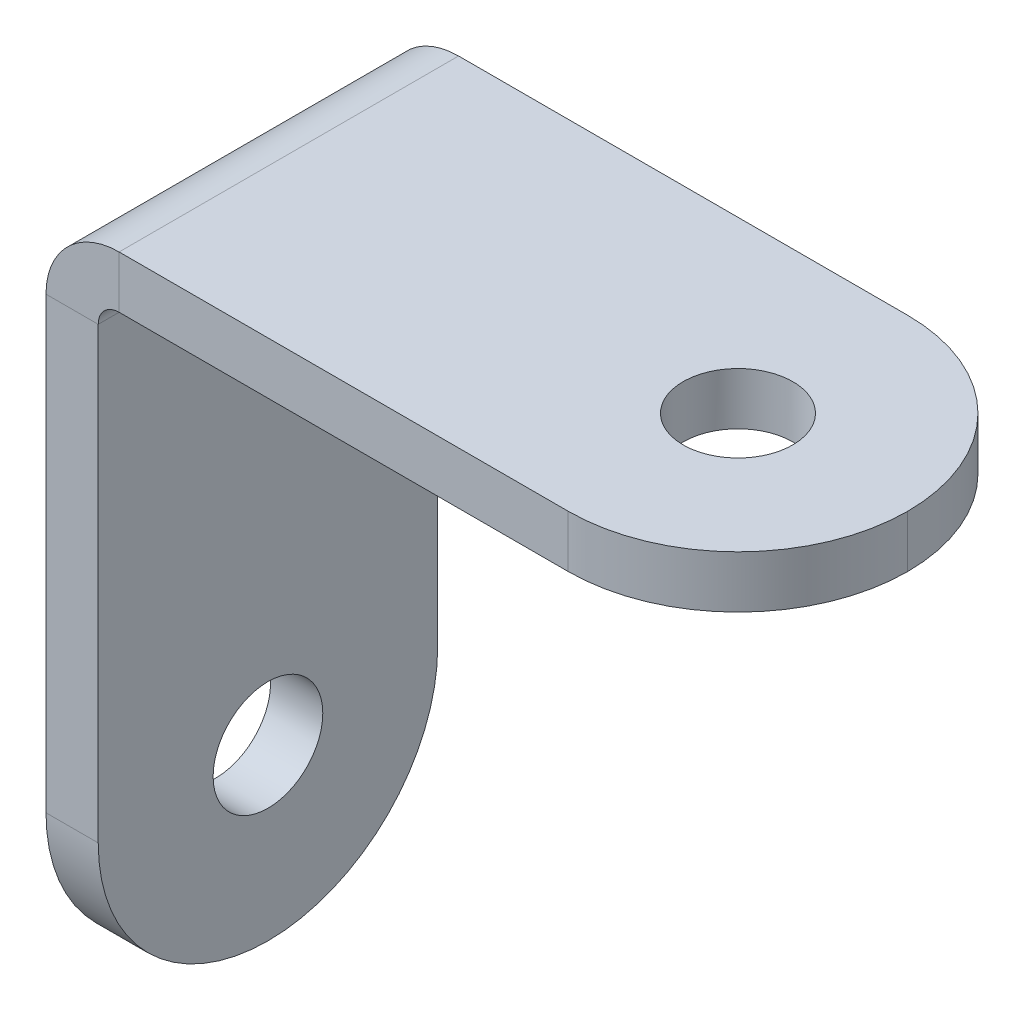
ISO-10303-21;
HEADER;
FILE_DESCRIPTION(('STEP AP214'),'2;1');
FILE_NAME('part.step','',(''),(''),'','','');
FILE_SCHEMA(('AUTOMOTIVE_DESIGN { 1 0 10303 214 1 1 1 1 }'));
ENDSEC;
DATA;
#1=APPLICATION_CONTEXT('core data for automotive mechanical design processes');
#2=APPLICATION_PROTOCOL_DEFINITION('international standard','automotive_design',2000,#1);
#3=PRODUCT_CONTEXT('',#1,'mechanical');
#4=PRODUCT('Part','Part','',(#3));
#5=PRODUCT_RELATED_PRODUCT_CATEGORY('part','',(#4));
#6=PRODUCT_DEFINITION_FORMATION('','',#4);
#7=PRODUCT_DEFINITION_CONTEXT('part definition',#1,'design');
#8=PRODUCT_DEFINITION('design','',#6,#7);
#9=PRODUCT_DEFINITION_SHAPE('','',#8);
#10=(LENGTH_UNIT() NAMED_UNIT(*) SI_UNIT(.MILLI.,.METRE.));
#11=(NAMED_UNIT(*) PLANE_ANGLE_UNIT() SI_UNIT($,.RADIAN.));
#12=(NAMED_UNIT(*) SI_UNIT($,.STERADIAN.) SOLID_ANGLE_UNIT());
#13=UNCERTAINTY_MEASURE_WITH_UNIT(LENGTH_MEASURE(1.E-05),#10,'distance_accuracy_value','');
#14=(GEOMETRIC_REPRESENTATION_CONTEXT(3) GLOBAL_UNCERTAINTY_ASSIGNED_CONTEXT((#13)) GLOBAL_UNIT_ASSIGNED_CONTEXT((#10,
#11,#12)) REPRESENTATION_CONTEXT('',''));
#15=CARTESIAN_POINT('',(0.,0.,0.));
#16=DIRECTION('',(0.,0.,1.));
#17=DIRECTION('',(1.,0.,0.));
#18=AXIS2_PLACEMENT_3D('',#15,#16,#17);
#19=CARTESIAN_POINT('',(-10.45,13.25,13.));
#20=DIRECTION('',(0.,0.,1.));
#21=DIRECTION('',(1.,0.,0.));
#22=AXIS2_PLACEMENT_3D('',#19,#20,#21);
#23=PLANE('',#22);
#24=DIRECTION('',(0.,-1.,0.));
#25=VECTOR('',#24,1.);
#26=CARTESIAN_POINT('',(-10.45,13.25,13.));
#27=LINE('',#26,#25);
#28=CARTESIAN_POINT('',(-10.45,13.25,13.));
#29=VERTEX_POINT('',#28);
#30=CARTESIAN_POINT('',(-10.45,11.25,13.));
#31=VERTEX_POINT('',#30);
#32=EDGE_CURVE('E126',#29,#31,#27,.T.);
#33=ORIENTED_EDGE('',*,*,#32,.F.);
#34=CARTESIAN_POINT('',(-10.45,10.45,13.));
#35=DIRECTION('',(0.,0.,-1.));
#36=DIRECTION('',(-1.,0.,0.));
#37=AXIS2_PLACEMENT_3D('',#34,#35,#36);
#38=CIRCLE('',#37,2.8);
#39=CARTESIAN_POINT('',(-13.25,10.45,13.));
#40=VERTEX_POINT('',#39);
#41=EDGE_CURVE('E121',#29,#40,#38,.F.);
#42=ORIENTED_EDGE('',*,*,#41,.T.);
#43=DIRECTION('',(-1.,0.,0.));
#44=VECTOR('',#43,1.);
#45=CARTESIAN_POINT('',(-11.25,10.45,13.));
#46=LINE('',#45,#44);
#47=CARTESIAN_POINT('',(-11.25,10.45,13.));
#48=VERTEX_POINT('',#47);
#49=EDGE_CURVE('E115',#48,#40,#46,.T.);
#50=ORIENTED_EDGE('',*,*,#49,.F.);
#51=CARTESIAN_POINT('',(-10.45,10.45,13.));
#52=DIRECTION('',(0.,0.,1.));
#53=DIRECTION('',(1.,0.,0.));
#54=AXIS2_PLACEMENT_3D('',#51,#52,#53);
#55=CIRCLE('',#54,0.8);
#56=EDGE_CURVE('E119',#31,#48,#55,.T.);
#57=ORIENTED_EDGE('',*,*,#56,.F.);
#58=EDGE_LOOP('',(#33,#42,#50,#57));
#59=FACE_BOUND('',#58,.T.);
#60=ADVANCED_FACE('F37',(#59),#23,.T.);
#61=CARTESIAN_POINT('',(-11.25,10.45,13.));
#62=DIRECTION('',(0.,0.,1.));
#63=DIRECTION('',(1.,0.,0.));
#64=AXIS2_PLACEMENT_3D('',#61,#62,#63);
#65=PLANE('',#64);
#66=DIRECTION('',(1.,0.,0.));
#67=VECTOR('',#66,1.);
#68=CARTESIAN_POINT('',(13.25,11.25,13.));
#69=LINE('',#68,#67);
#70=CARTESIAN_POINT('',(6.75,11.25,13.));
#71=VERTEX_POINT('',#70);
#72=EDGE_CURVE('E153',#71,#31,#69,.F.);
#73=ORIENTED_EDGE('',*,*,#72,.F.);
#74=DIRECTION('',(0.,-1.,0.));
#75=VECTOR('',#74,1.);
#76=CARTESIAN_POINT('',(6.75,10.45,13.));
#77=LINE('',#76,#75);
#78=CARTESIAN_POINT('',(6.75,13.25,13.));
#79=VERTEX_POINT('',#78);
#80=EDGE_CURVE('E11',#71,#79,#77,.F.);
#81=ORIENTED_EDGE('',*,*,#80,.T.);
#82=DIRECTION('',(-1.,0.,0.));
#83=VECTOR('',#82,1.);
#84=CARTESIAN_POINT('',(13.25,13.25,13.));
#85=LINE('',#84,#83);
#86=EDGE_CURVE('E155',#79,#29,#85,.T.);
#87=ORIENTED_EDGE('',*,*,#86,.T.);
#88=ORIENTED_EDGE('',*,*,#32,.T.);
#89=EDGE_LOOP('',(#73,#81,#87,#88));
#90=FACE_BOUND('',#89,.T.);
#91=ADVANCED_FACE('F248',(#90),#65,.T.);
#92=CARTESIAN_POINT('',(-13.25,10.45,0.));
#93=DIRECTION('',(0.,0.,-1.));
#94=DIRECTION('',(-1.,0.,0.));
#95=AXIS2_PLACEMENT_3D('',#92,#93,#94);
#96=PLANE('',#95);
#97=DIRECTION('',(1.,0.,0.));
#98=VECTOR('',#97,1.);
#99=CARTESIAN_POINT('',(-13.25,10.45,0.));
#100=LINE('',#99,#98);
#101=CARTESIAN_POINT('',(-13.25,10.45,0.));
#102=VERTEX_POINT('',#101);
#103=CARTESIAN_POINT('',(-11.25,10.45,0.));
#104=VERTEX_POINT('',#103);
#105=EDGE_CURVE('E127',#102,#104,#100,.T.);
#106=ORIENTED_EDGE('',*,*,#105,.F.);
#107=CARTESIAN_POINT('',(-10.45,10.45,0.));
#108=DIRECTION('',(0.,0.,-1.));
#109=DIRECTION('',(-1.,0.,0.));
#110=AXIS2_PLACEMENT_3D('',#107,#108,#109);
#111=CIRCLE('',#110,2.8);
#112=CARTESIAN_POINT('',(-10.45,13.25,0.));
#113=VERTEX_POINT('',#112);
#114=EDGE_CURVE('E173',#113,#102,#111,.F.);
#115=ORIENTED_EDGE('',*,*,#114,.F.);
#116=DIRECTION('',(0.,1.,0.));
#117=VECTOR('',#116,1.);
#118=CARTESIAN_POINT('',(-10.45,11.25,0.));
#119=LINE('',#118,#117);
#120=CARTESIAN_POINT('',(-10.45,11.25,0.));
#121=VERTEX_POINT('',#120);
#122=EDGE_CURVE('E142',#121,#113,#119,.T.);
#123=ORIENTED_EDGE('',*,*,#122,.F.);
#124=CARTESIAN_POINT('',(-10.45,10.45,0.));
#125=DIRECTION('',(0.,0.,1.));
#126=DIRECTION('',(1.,0.,0.));
#127=AXIS2_PLACEMENT_3D('',#124,#125,#126);
#128=CIRCLE('',#127,0.8);
#129=EDGE_CURVE('E167',#121,#104,#128,.T.);
#130=ORIENTED_EDGE('',*,*,#129,.T.);
#131=EDGE_LOOP('',(#106,#115,#123,#130));
#132=FACE_BOUND('',#131,.T.);
#133=ADVANCED_FACE('F241',(#132),#96,.T.);
#134=CARTESIAN_POINT('',(-10.45,11.25,0.));
#135=DIRECTION('',(0.,0.,-1.));
#136=DIRECTION('',(-1.,0.,0.));
#137=AXIS2_PLACEMENT_3D('',#134,#135,#136);
#138=PLANE('',#137);
#139=DIRECTION('',(0.,1.,0.));
#140=VECTOR('',#139,1.);
#141=CARTESIAN_POINT('',(-11.25,13.25,0.));
#142=LINE('',#141,#140);
#143=CARTESIAN_POINT('',(-11.25,-6.75000000000001,0.));
#144=VERTEX_POINT('',#143);
#145=EDGE_CURVE('E138',#104,#144,#142,.F.);
#146=ORIENTED_EDGE('',*,*,#145,.T.);
#147=DIRECTION('',(-1.,0.,0.));
#148=VECTOR('',#147,1.);
#149=CARTESIAN_POINT('',(-10.45,-6.75,0.));
#150=LINE('',#149,#148);
#151=CARTESIAN_POINT('',(-13.25,-6.75000000000001,0.));
#152=VERTEX_POINT('',#151);
#153=EDGE_CURVE('E187',#144,#152,#150,.T.);
#154=ORIENTED_EDGE('',*,*,#153,.T.);
#155=DIRECTION('',(0.,-1.,0.));
#156=VECTOR('',#155,1.);
#157=CARTESIAN_POINT('',(-13.25,13.25,0.));
#158=LINE('',#157,#156);
#159=EDGE_CURVE('E162',#102,#152,#158,.T.);
#160=ORIENTED_EDGE('',*,*,#159,.F.);
#161=ORIENTED_EDGE('',*,*,#105,.T.);
#162=EDGE_LOOP('',(#146,#154,#160,#161));
#163=FACE_BOUND('',#162,.T.);
#164=ADVANCED_FACE('F231',(#163),#138,.T.);
#165=CARTESIAN_POINT('',(-13.25,13.25,13.));
#166=DIRECTION('',(1.,0.,0.));
#167=DIRECTION('',(0.,0.,-1.));
#168=AXIS2_PLACEMENT_3D('',#165,#166,#167);
#169=PLANE('',#168);
#170=CARTESIAN_POINT('',(-13.25,-6.75,6.5));
#171=DIRECTION('',(-1.,0.,0.));
#172=DIRECTION('',(0.,0.,1.));
#173=AXIS2_PLACEMENT_3D('',#170,#171,#172);
#174=CIRCLE('',#173,2.09999999999999);
#175=CARTESIAN_POINT('',(-13.25,-6.75,8.59999999999999));
#176=VERTEX_POINT('',#175);
#177=EDGE_CURVE('E386',#176,#176,#174,.T.);
#178=ORIENTED_EDGE('',*,*,#177,.F.);
#179=EDGE_LOOP('',(#178));
#180=FACE_BOUND('',#179,.T.);
#181=ORIENTED_EDGE('',*,*,#159,.T.);
#182=CARTESIAN_POINT('',(-13.25,-6.75,6.5));
#183=DIRECTION('',(1.,0.,0.));
#184=DIRECTION('',(0.,0.,-1.));
#185=AXIS2_PLACEMENT_3D('',#182,#183,#184);
#186=CIRCLE('',#185,6.5);
#187=CARTESIAN_POINT('',(-13.25,-13.25,6.5));
#188=VERTEX_POINT('',#187);
#189=EDGE_CURVE('E192',#152,#188,#186,.F.);
#190=ORIENTED_EDGE('',*,*,#189,.T.);
#191=CARTESIAN_POINT('',(-13.25,-6.75,6.5));
#192=DIRECTION('',(1.,0.,0.));
#193=DIRECTION('',(0.,0.,-1.));
#194=AXIS2_PLACEMENT_3D('',#191,#192,#193);
#195=CIRCLE('',#194,6.5);
#196=CARTESIAN_POINT('',(-13.25,-6.75,13.));
#197=VERTEX_POINT('',#196);
#198=EDGE_CURVE('E190',#188,#197,#195,.F.);
#199=ORIENTED_EDGE('',*,*,#198,.T.);
#200=DIRECTION('',(0.,-1.,0.));
#201=VECTOR('',#200,1.);
#202=CARTESIAN_POINT('',(-13.25,13.25,13.));
#203=LINE('',#202,#201);
#204=EDGE_CURVE('E148',#40,#197,#203,.T.);
#205=ORIENTED_EDGE('',*,*,#204,.F.);
#206=DIRECTION('',(0.,0.,-1.));
#207=VECTOR('',#206,1.);
#208=CARTESIAN_POINT('',(-13.25,10.45,13.));
#209=LINE('',#208,#207);
#210=EDGE_CURVE('E161',#40,#102,#209,.T.);
#211=ORIENTED_EDGE('',*,*,#210,.T.);
#212=EDGE_LOOP('',(#181,#190,#199,#205,#211));
#213=FACE_BOUND('',#212,.T.);
#214=ADVANCED_FACE('F234',(#180,#213),#169,.F.);
#215=CARTESIAN_POINT('',(-11.25,13.25,13.));
#216=DIRECTION('',(1.,0.,0.));
#217=DIRECTION('',(0.,0.,-1.));
#218=AXIS2_PLACEMENT_3D('',#215,#216,#217);
#219=PLANE('',#218);
#220=CARTESIAN_POINT('',(-11.25,-6.75,6.5));
#221=DIRECTION('',(1.,0.,0.));
#222=DIRECTION('',(0.,0.,-1.));
#223=AXIS2_PLACEMENT_3D('',#220,#221,#222);
#224=CIRCLE('',#223,2.09999999999999);
#225=CARTESIAN_POINT('',(-11.25,-6.75,4.40000000000001));
#226=VERTEX_POINT('',#225);
#227=EDGE_CURVE('E221',#226,#226,#224,.T.);
#228=ORIENTED_EDGE('',*,*,#227,.F.);
#229=EDGE_LOOP('',(#228));
#230=FACE_BOUND('',#229,.T.);
#231=CARTESIAN_POINT('',(-11.25,-6.75,6.5));
#232=DIRECTION('',(1.,0.,0.));
#233=DIRECTION('',(0.,0.,-1.));
#234=AXIS2_PLACEMENT_3D('',#231,#232,#233);
#235=CIRCLE('',#234,6.5);
#236=CARTESIAN_POINT('',(-11.25,-6.75,13.));
#237=VERTEX_POINT('',#236);
#238=CARTESIAN_POINT('',(-11.25,-13.25,6.5));
#239=VERTEX_POINT('',#238);
#240=EDGE_CURVE('E194',#237,#239,#235,.T.);
#241=ORIENTED_EDGE('',*,*,#240,.T.);
#242=CARTESIAN_POINT('',(-11.25,-6.75,6.5));
#243=DIRECTION('',(1.,0.,0.));
#244=DIRECTION('',(0.,0.,-1.));
#245=AXIS2_PLACEMENT_3D('',#242,#243,#244);
#246=CIRCLE('',#245,6.5);
#247=EDGE_CURVE('E196',#239,#144,#246,.T.);
#248=ORIENTED_EDGE('',*,*,#247,.T.);
#249=ORIENTED_EDGE('',*,*,#145,.F.);
#250=DIRECTION('',(0.,0.,-1.));
#251=VECTOR('',#250,1.);
#252=CARTESIAN_POINT('',(-11.25,10.45,13.));
#253=LINE('',#252,#251);
#254=EDGE_CURVE('E133',#48,#104,#253,.T.);
#255=ORIENTED_EDGE('',*,*,#254,.F.);
#256=DIRECTION('',(0.,1.,0.));
#257=VECTOR('',#256,1.);
#258=CARTESIAN_POINT('',(-11.25,13.25,13.));
#259=LINE('',#258,#257);
#260=EDGE_CURVE('E135',#48,#237,#259,.F.);
#261=ORIENTED_EDGE('',*,*,#260,.T.);
#262=EDGE_LOOP('',(#241,#248,#249,#255,#261));
#263=FACE_BOUND('',#262,.T.);
#264=ADVANCED_FACE('F134',(#230,#263),#219,.T.);
#265=CARTESIAN_POINT('',(-10.45,10.45,13.));
#266=DIRECTION('',(0.,0.,-1.));
#267=DIRECTION('',(-1.,0.,0.));
#268=AXIS2_PLACEMENT_3D('',#265,#266,#267);
#269=CYLINDRICAL_SURFACE('',#268,0.8);
#270=ORIENTED_EDGE('',*,*,#129,.F.);
#271=DIRECTION('',(0.,0.,-1.));
#272=VECTOR('',#271,1.);
#273=CARTESIAN_POINT('',(-10.45,11.25,13.));
#274=LINE('',#273,#272);
#275=EDGE_CURVE('E143',#31,#121,#274,.T.);
#276=ORIENTED_EDGE('',*,*,#275,.F.);
#277=ORIENTED_EDGE('',*,*,#56,.T.);
#278=ORIENTED_EDGE('',*,*,#254,.T.);
#279=EDGE_LOOP('',(#270,#276,#277,#278));
#280=FACE_BOUND('',#279,.T.);
#281=ADVANCED_FACE('F151',(#280),#269,.F.);
#282=CARTESIAN_POINT('',(13.25,11.25,13.));
#283=DIRECTION('',(0.,-1.,0.));
#284=DIRECTION('',(0.,0.,-1.));
#285=AXIS2_PLACEMENT_3D('',#282,#283,#284);
#286=PLANE('',#285);
#287=CARTESIAN_POINT('',(6.75,11.25,6.5));
#288=DIRECTION('',(0.,-1.,0.));
#289=DIRECTION('',(0.,0.,-1.));
#290=AXIS2_PLACEMENT_3D('',#287,#288,#289);
#291=CIRCLE('',#290,2.09999999999999);
#292=CARTESIAN_POINT('',(6.75,11.25,4.40000000000001));
#293=VERTEX_POINT('',#292);
#294=EDGE_CURVE('E212',#293,#293,#291,.T.);
#295=ORIENTED_EDGE('',*,*,#294,.F.);
#296=EDGE_LOOP('',(#295));
#297=FACE_BOUND('',#296,.T.);
#298=DIRECTION('',(1.,0.,0.));
#299=VECTOR('',#298,1.);
#300=CARTESIAN_POINT('',(13.25,11.25,0.));
#301=LINE('',#300,#299);
#302=CARTESIAN_POINT('',(6.75,11.25,0.));
#303=VERTEX_POINT('',#302);
#304=EDGE_CURVE('E169',#303,#121,#301,.F.);
#305=ORIENTED_EDGE('',*,*,#304,.F.);
#306=CARTESIAN_POINT('',(6.75,11.25,6.5));
#307=DIRECTION('',(0.,-1.,0.));
#308=DIRECTION('',(0.,0.,-1.));
#309=AXIS2_PLACEMENT_3D('',#306,#307,#308);
#310=CIRCLE('',#309,6.5);
#311=CARTESIAN_POINT('',(13.25,11.25,6.5));
#312=VERTEX_POINT('',#311);
#313=EDGE_CURVE('E204',#303,#312,#310,.T.);
#314=ORIENTED_EDGE('',*,*,#313,.T.);
#315=CARTESIAN_POINT('',(6.75,11.25,6.5));
#316=DIRECTION('',(0.,-1.,0.));
#317=DIRECTION('',(0.,0.,-1.));
#318=AXIS2_PLACEMENT_3D('',#315,#316,#317);
#319=CIRCLE('',#318,6.5);
#320=EDGE_CURVE('E202',#312,#71,#319,.T.);
#321=ORIENTED_EDGE('',*,*,#320,.T.);
#322=ORIENTED_EDGE('',*,*,#72,.T.);
#323=ORIENTED_EDGE('',*,*,#275,.T.);
#324=EDGE_LOOP('',(#305,#314,#321,#322,#323));
#325=FACE_BOUND('',#324,.T.);
#326=ADVANCED_FACE('F246',(#297,#325),#286,.T.);
#327=CARTESIAN_POINT('',(13.25,13.25,13.));
#328=DIRECTION('',(0.,-1.,0.));
#329=DIRECTION('',(0.,0.,-1.));
#330=AXIS2_PLACEMENT_3D('',#327,#328,#329);
#331=PLANE('',#330);
#332=CARTESIAN_POINT('',(6.75,13.25,6.5));
#333=DIRECTION('',(0.,1.,0.));
#334=DIRECTION('',(0.,0.,1.));
#335=AXIS2_PLACEMENT_3D('',#332,#333,#334);
#336=CIRCLE('',#335,2.09999999999999);
#337=CARTESIAN_POINT('',(6.75,13.25,8.59999999999999));
#338=VERTEX_POINT('',#337);
#339=EDGE_CURVE('E216',#338,#338,#336,.T.);
#340=ORIENTED_EDGE('',*,*,#339,.F.);
#341=EDGE_LOOP('',(#340));
#342=FACE_BOUND('',#341,.T.);
#343=CARTESIAN_POINT('',(6.75,13.25,6.5));
#344=DIRECTION('',(0.,-1.,0.));
#345=DIRECTION('',(0.,0.,-1.));
#346=AXIS2_PLACEMENT_3D('',#343,#344,#345);
#347=CIRCLE('',#346,6.5);
#348=CARTESIAN_POINT('',(13.25,13.25,6.5));
#349=VERTEX_POINT('',#348);
#350=EDGE_CURVE('E54',#79,#349,#347,.F.);
#351=ORIENTED_EDGE('',*,*,#350,.T.);
#352=CARTESIAN_POINT('',(6.75,13.25,6.5));
#353=DIRECTION('',(0.,-1.,0.));
#354=DIRECTION('',(0.,0.,-1.));
#355=AXIS2_PLACEMENT_3D('',#352,#353,#354);
#356=CIRCLE('',#355,6.5);
#357=CARTESIAN_POINT('',(6.75,13.25,0.));
#358=VERTEX_POINT('',#357);
#359=EDGE_CURVE('E46',#349,#358,#356,.F.);
#360=ORIENTED_EDGE('',*,*,#359,.T.);
#361=DIRECTION('',(-1.,0.,0.));
#362=VECTOR('',#361,1.);
#363=CARTESIAN_POINT('',(13.25,13.25,0.));
#364=LINE('',#363,#362);
#365=EDGE_CURVE('E171',#358,#113,#364,.T.);
#366=ORIENTED_EDGE('',*,*,#365,.T.);
#367=DIRECTION('',(0.,0.,-1.));
#368=VECTOR('',#367,1.);
#369=CARTESIAN_POINT('',(-10.45,13.25,13.));
#370=LINE('',#369,#368);
#371=EDGE_CURVE('E178',#29,#113,#370,.T.);
#372=ORIENTED_EDGE('',*,*,#371,.F.);
#373=ORIENTED_EDGE('',*,*,#86,.F.);
#374=EDGE_LOOP('',(#351,#360,#366,#372,#373));
#375=FACE_BOUND('',#374,.T.);
#376=ADVANCED_FACE('F249',(#342,#375),#331,.F.);
#377=CARTESIAN_POINT('',(-10.45,10.45,13.));
#378=DIRECTION('',(0.,0.,-1.));
#379=DIRECTION('',(-1.,0.,0.));
#380=AXIS2_PLACEMENT_3D('',#377,#378,#379);
#381=CYLINDRICAL_SURFACE('',#380,2.8);
#382=ORIENTED_EDGE('',*,*,#114,.T.);
#383=ORIENTED_EDGE('',*,*,#210,.F.);
#384=ORIENTED_EDGE('',*,*,#41,.F.);
#385=ORIENTED_EDGE('',*,*,#371,.T.);
#386=EDGE_LOOP('',(#382,#383,#384,#385));
#387=FACE_BOUND('',#386,.T.);
#388=ADVANCED_FACE('F236',(#387),#381,.T.);
#389=CARTESIAN_POINT('',(-10.45,10.45,13.));
#390=DIRECTION('',(0.,0.,1.));
#391=DIRECTION('',(1.,0.,0.));
#392=AXIS2_PLACEMENT_3D('',#389,#390,#391);
#393=PLANE('',#392);
#394=ORIENTED_EDGE('',*,*,#204,.T.);
#395=DIRECTION('',(-1.,0.,0.));
#396=VECTOR('',#395,1.);
#397=CARTESIAN_POINT('',(-10.45,-6.75,13.));
#398=LINE('',#397,#396);
#399=EDGE_CURVE('E147',#197,#237,#398,.F.);
#400=ORIENTED_EDGE('',*,*,#399,.T.);
#401=ORIENTED_EDGE('',*,*,#260,.F.);
#402=ORIENTED_EDGE('',*,*,#49,.T.);
#403=EDGE_LOOP('',(#394,#400,#401,#402));
#404=FACE_BOUND('',#403,.T.);
#405=ADVANCED_FACE('F145',(#404),#393,.T.);
#406=CARTESIAN_POINT('',(-10.45,10.45,0.));
#407=DIRECTION('',(0.,0.,1.));
#408=DIRECTION('',(1.,0.,0.));
#409=AXIS2_PLACEMENT_3D('',#406,#407,#408);
#410=PLANE('',#409);
#411=ORIENTED_EDGE('',*,*,#365,.F.);
#412=DIRECTION('',(0.,-1.,0.));
#413=VECTOR('',#412,1.);
#414=CARTESIAN_POINT('',(6.75,11.25,0.));
#415=LINE('',#414,#413);
#416=EDGE_CURVE('E199',#358,#303,#415,.T.);
#417=ORIENTED_EDGE('',*,*,#416,.T.);
#418=ORIENTED_EDGE('',*,*,#304,.T.);
#419=ORIENTED_EDGE('',*,*,#122,.T.);
#420=EDGE_LOOP('',(#411,#417,#418,#419));
#421=FACE_BOUND('',#420,.T.);
#422=ADVANCED_FACE('F251',(#421),#410,.F.);
#423=CARTESIAN_POINT('',(-11.25,-6.75,6.5));
#424=DIRECTION('',(-1.,0.,0.));
#425=DIRECTION('',(0.,0.,1.));
#426=AXIS2_PLACEMENT_3D('',#423,#424,#425);
#427=CYLINDRICAL_SURFACE('',#426,6.5);
#428=DIRECTION('',(-1.,0.,0.));
#429=VECTOR('',#428,1.);
#430=CARTESIAN_POINT('',(-11.25,-13.25,6.5));
#431=LINE('',#430,#429);
#432=EDGE_CURVE('E165',#239,#188,#431,.T.);
#433=ORIENTED_EDGE('',*,*,#432,.F.);
#434=ORIENTED_EDGE('',*,*,#240,.F.);
#435=ORIENTED_EDGE('',*,*,#399,.F.);
#436=ORIENTED_EDGE('',*,*,#198,.F.);
#437=EDGE_LOOP('',(#433,#434,#435,#436));
#438=FACE_BOUND('',#437,.T.);
#439=ADVANCED_FACE('F228',(#438),#427,.T.);
#440=CARTESIAN_POINT('',(-10.45,-6.75,6.5));
#441=DIRECTION('',(-1.,0.,0.));
#442=DIRECTION('',(0.,0.,1.));
#443=AXIS2_PLACEMENT_3D('',#440,#441,#442);
#444=CYLINDRICAL_SURFACE('',#443,6.5);
#445=ORIENTED_EDGE('',*,*,#247,.F.);
#446=ORIENTED_EDGE('',*,*,#432,.T.);
#447=ORIENTED_EDGE('',*,*,#189,.F.);
#448=ORIENTED_EDGE('',*,*,#153,.F.);
#449=EDGE_LOOP('',(#445,#446,#447,#448));
#450=FACE_BOUND('',#449,.T.);
#451=ADVANCED_FACE('F233',(#450),#444,.T.);
#452=CARTESIAN_POINT('',(6.75,13.25,6.5));
#453=DIRECTION('',(0.,-1.,0.));
#454=DIRECTION('',(0.,0.,-1.));
#455=AXIS2_PLACEMENT_3D('',#452,#453,#454);
#456=CYLINDRICAL_SURFACE('',#455,6.5);
#457=DIRECTION('',(0.,-1.,0.));
#458=VECTOR('',#457,1.);
#459=CARTESIAN_POINT('',(13.25,13.25,6.5));
#460=LINE('',#459,#458);
#461=EDGE_CURVE('E41',#349,#312,#460,.T.);
#462=ORIENTED_EDGE('',*,*,#461,.F.);
#463=ORIENTED_EDGE('',*,*,#350,.F.);
#464=ORIENTED_EDGE('',*,*,#80,.F.);
#465=ORIENTED_EDGE('',*,*,#320,.F.);
#466=EDGE_LOOP('',(#462,#463,#464,#465));
#467=FACE_BOUND('',#466,.T.);
#468=ADVANCED_FACE('F39',(#467),#456,.T.);
#469=CARTESIAN_POINT('',(6.75,10.45,6.5));
#470=DIRECTION('',(0.,1.,0.));
#471=DIRECTION('',(0.,0.,1.));
#472=AXIS2_PLACEMENT_3D('',#469,#470,#471);
#473=CYLINDRICAL_SURFACE('',#472,6.5);
#474=ORIENTED_EDGE('',*,*,#359,.F.);
#475=ORIENTED_EDGE('',*,*,#461,.T.);
#476=ORIENTED_EDGE('',*,*,#313,.F.);
#477=ORIENTED_EDGE('',*,*,#416,.F.);
#478=EDGE_LOOP('',(#474,#475,#476,#477));
#479=FACE_BOUND('',#478,.T.);
#480=ADVANCED_FACE('F252',(#479),#473,.T.);
#481=CARTESIAN_POINT('',(6.75,13.25,6.5));
#482=DIRECTION('',(0.,1.,0.));
#483=DIRECTION('',(0.,0.,1.));
#484=AXIS2_PLACEMENT_3D('',#481,#482,#483);
#485=CYLINDRICAL_SURFACE('',#484,2.09999999999999);
#486=ORIENTED_EDGE('',*,*,#294,.T.);
#487=EDGE_LOOP('',(#486));
#488=FACE_BOUND('',#487,.T.);
#489=ORIENTED_EDGE('',*,*,#339,.T.);
#490=EDGE_LOOP('',(#489));
#491=FACE_BOUND('',#490,.T.);
#492=ADVANCED_FACE('F259',(#488,#491),#485,.F.);
#493=CARTESIAN_POINT('',(-13.25,-6.75,6.5));
#494=DIRECTION('',(-1.,0.,0.));
#495=DIRECTION('',(0.,0.,1.));
#496=AXIS2_PLACEMENT_3D('',#493,#494,#495);
#497=CYLINDRICAL_SURFACE('',#496,2.09999999999999);
#498=ORIENTED_EDGE('',*,*,#227,.T.);
#499=EDGE_LOOP('',(#498));
#500=FACE_BOUND('',#499,.T.);
#501=ORIENTED_EDGE('',*,*,#177,.T.);
#502=EDGE_LOOP('',(#501));
#503=FACE_BOUND('',#502,.T.);
#504=ADVANCED_FACE('F370',(#500,#503),#497,.F.);
#505=CLOSED_SHELL('',(#60,#91,#133,#164,#214,#264,#281,#326,#376,#388,#405,#422,#439,#451,#468,
#480,#492,#504));
#506=MANIFOLD_SOLID_BREP('B2',#505);
#507=ADVANCED_BREP_SHAPE_REPRESENTATION('',(#18,#506),#14);
#508=SHAPE_DEFINITION_REPRESENTATION(#9,#507);
ENDSEC;
END-ISO-10303-21;
